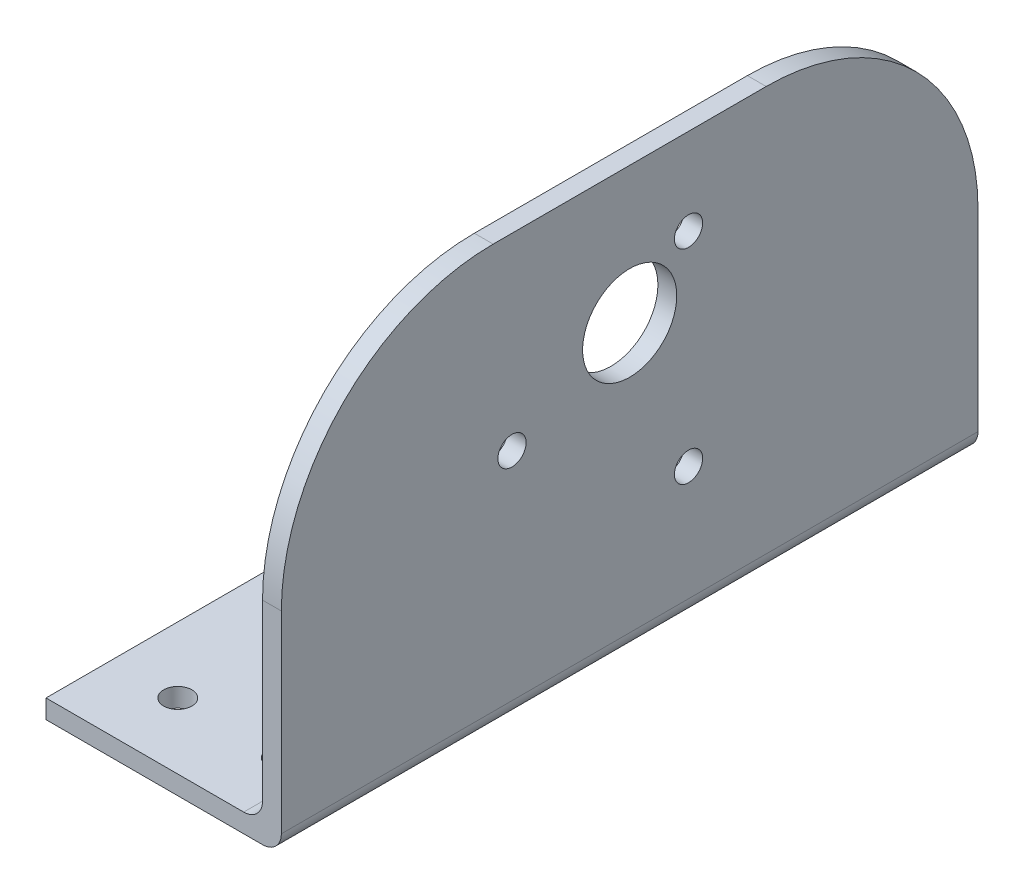
ISO-10303-21;
HEADER;
FILE_DESCRIPTION(('STEP AP214'),'2;1');
FILE_NAME('part.step','',(''),(''),'','','');
FILE_SCHEMA(('AUTOMOTIVE_DESIGN { 1 0 10303 214 1 1 1 1 }'));
ENDSEC;
DATA;
#1=APPLICATION_CONTEXT('core data for automotive mechanical design processes');
#2=APPLICATION_PROTOCOL_DEFINITION('international standard','automotive_design',2000,#1);
#3=PRODUCT_CONTEXT('',#1,'mechanical');
#4=PRODUCT('Part','Part','',(#3));
#5=PRODUCT_RELATED_PRODUCT_CATEGORY('part','',(#4));
#6=PRODUCT_DEFINITION_FORMATION('','',#4);
#7=PRODUCT_DEFINITION_CONTEXT('part definition',#1,'design');
#8=PRODUCT_DEFINITION('design','',#6,#7);
#9=PRODUCT_DEFINITION_SHAPE('','',#8);
#10=(LENGTH_UNIT() NAMED_UNIT(*) SI_UNIT(.MILLI.,.METRE.));
#11=(NAMED_UNIT(*) PLANE_ANGLE_UNIT() SI_UNIT($,.RADIAN.));
#12=(NAMED_UNIT(*) SI_UNIT($,.STERADIAN.) SOLID_ANGLE_UNIT());
#13=UNCERTAINTY_MEASURE_WITH_UNIT(LENGTH_MEASURE(1.E-05),#10,'distance_accuracy_value','');
#14=(GEOMETRIC_REPRESENTATION_CONTEXT(3) GLOBAL_UNCERTAINTY_ASSIGNED_CONTEXT((#13)) GLOBAL_UNIT_ASSIGNED_CONTEXT((#10,
#11,#12)) REPRESENTATION_CONTEXT('',''));
#15=CARTESIAN_POINT('',(0.,0.,0.));
#16=DIRECTION('',(0.,0.,1.));
#17=DIRECTION('',(1.,0.,0.));
#18=AXIS2_PLACEMENT_3D('',#15,#16,#17);
#19=CARTESIAN_POINT('',(0.,22.5,-14.5));
#20=DIRECTION('',(1.,0.,0.));
#21=DIRECTION('',(0.,0.,-1.));
#22=AXIS2_PLACEMENT_3D('',#19,#20,#21);
#23=PLANE('',#22);
#24=CARTESIAN_POINT('',(0.,24.9999999999998,12.4999999999999));
#25=DIRECTION('',(1.,0.,0.));
#26=DIRECTION('',(0.,0.,-1.));
#27=AXIS2_PLACEMENT_3D('',#24,#25,#26);
#28=CIRCLE('',#27,1.5);
#29=CARTESIAN_POINT('',(0.,24.9999999999998,10.9999999999999));
#30=VERTEX_POINT('',#29);
#31=EDGE_CURVE('E239',#30,#30,#28,.T.);
#32=ORIENTED_EDGE('',*,*,#31,.T.);
#33=EDGE_LOOP('',(#32));
#34=FACE_BOUND('',#33,.T.);
#35=CARTESIAN_POINT('',(0.,14.1746824526946,-6.24999999999998));
#36=DIRECTION('',(1.,0.,0.));
#37=DIRECTION('',(0.,0.,-1.));
#38=AXIS2_PLACEMENT_3D('',#35,#36,#37);
#39=CIRCLE('',#38,1.5);
#40=CARTESIAN_POINT('',(0.,14.1746824526946,-7.74999999999998));
#41=VERTEX_POINT('',#40);
#42=EDGE_CURVE('E233',#41,#41,#39,.T.);
#43=ORIENTED_EDGE('',*,*,#42,.T.);
#44=EDGE_LOOP('',(#43));
#45=FACE_BOUND('',#44,.T.);
#46=CARTESIAN_POINT('',(0.,30.5,0.));
#47=DIRECTION('',(1.,0.,0.));
#48=DIRECTION('',(0.,0.,-1.));
#49=AXIS2_PLACEMENT_3D('',#46,#47,#48);
#50=CIRCLE('',#49,5.);
#51=CARTESIAN_POINT('',(0.,30.5,-5.));
#52=VERTEX_POINT('',#51);
#53=EDGE_CURVE('E227',#52,#52,#50,.T.);
#54=ORIENTED_EDGE('',*,*,#53,.T.);
#55=EDGE_LOOP('',(#54));
#56=FACE_BOUND('',#55,.T.);
#57=CARTESIAN_POINT('',(0.,35.8253175473055,-6.24999999999993));
#58=DIRECTION('',(1.,0.,0.));
#59=DIRECTION('',(0.,0.,-1.));
#60=AXIS2_PLACEMENT_3D('',#57,#58,#59);
#61=CIRCLE('',#60,1.50000000000003);
#62=CARTESIAN_POINT('',(0.,35.8253175473055,-7.74999999999996));
#63=VERTEX_POINT('',#62);
#64=EDGE_CURVE('E144',#63,#63,#61,.T.);
#65=ORIENTED_EDGE('',*,*,#64,.T.);
#66=EDGE_LOOP('',(#65));
#67=FACE_BOUND('',#66,.T.);
#68=DIRECTION('',(0.,1.,0.));
#69=VECTOR('',#68,1.);
#70=CARTESIAN_POINT('',(0.,22.5,-37.));
#71=LINE('',#70,#69);
#72=CARTESIAN_POINT('',(0.,4.,-37.));
#73=VERTEX_POINT('',#72);
#74=CARTESIAN_POINT('',(0.,22.5,-37.));
#75=VERTEX_POINT('',#74);
#76=EDGE_CURVE('E169',#73,#75,#71,.T.);
#77=ORIENTED_EDGE('',*,*,#76,.F.);
#78=DIRECTION('',(0.,0.,-1.));
#79=VECTOR('',#78,1.);
#80=CARTESIAN_POINT('',(0.,4.,37.));
#81=LINE('',#80,#79);
#82=CARTESIAN_POINT('',(0.,4.,37.));
#83=VERTEX_POINT('',#82);
#84=EDGE_CURVE('E167',#73,#83,#81,.F.);
#85=ORIENTED_EDGE('',*,*,#84,.T.);
#86=DIRECTION('',(0.,-1.,0.));
#87=VECTOR('',#86,1.);
#88=CARTESIAN_POINT('',(0.,22.5,37.));
#89=LINE('',#88,#87);
#90=CARTESIAN_POINT('',(0.,22.5,37.));
#91=VERTEX_POINT('',#90);
#92=EDGE_CURVE('E173',#91,#83,#89,.T.);
#93=ORIENTED_EDGE('',*,*,#92,.F.);
#94=CARTESIAN_POINT('',(0.,22.5,14.5));
#95=DIRECTION('',(1.,0.,0.));
#96=DIRECTION('',(0.,0.,1.));
#97=AXIS2_PLACEMENT_3D('',#94,#95,#96);
#98=CIRCLE('',#97,22.5);
#99=CARTESIAN_POINT('',(0.,45.,14.5));
#100=VERTEX_POINT('',#99);
#101=EDGE_CURVE('E200',#100,#91,#98,.T.);
#102=ORIENTED_EDGE('',*,*,#101,.F.);
#103=DIRECTION('',(0.,0.,1.));
#104=VECTOR('',#103,1.);
#105=CARTESIAN_POINT('',(0.,45.,14.5));
#106=LINE('',#105,#104);
#107=CARTESIAN_POINT('',(0.,45.,-14.5));
#108=VERTEX_POINT('',#107);
#109=EDGE_CURVE('E155',#108,#100,#106,.T.);
#110=ORIENTED_EDGE('',*,*,#109,.F.);
#111=CARTESIAN_POINT('',(0.,22.5,-14.5));
#112=DIRECTION('',(1.,0.,0.));
#113=DIRECTION('',(0.,0.,-1.));
#114=AXIS2_PLACEMENT_3D('',#111,#112,#113);
#115=CIRCLE('',#114,22.5);
#116=EDGE_CURVE('E150',#75,#108,#115,.T.);
#117=ORIENTED_EDGE('',*,*,#116,.F.);
#118=EDGE_LOOP('',(#77,#85,#93,#102,#110,#117));
#119=FACE_BOUND('',#118,.T.);
#120=ADVANCED_FACE('F38',(#34,#45,#56,#67,#119),#23,.F.);
#121=CARTESIAN_POINT('',(2.,22.5,-14.5));
#122=DIRECTION('',(-1.,0.,0.));
#123=DIRECTION('',(0.,0.,1.));
#124=AXIS2_PLACEMENT_3D('',#121,#122,#123);
#125=CYLINDRICAL_SURFACE('',#124,22.5);
#126=ORIENTED_EDGE('',*,*,#116,.T.);
#127=DIRECTION('',(-1.,0.,0.));
#128=VECTOR('',#127,1.);
#129=CARTESIAN_POINT('',(2.,45.,-14.5));
#130=LINE('',#129,#128);
#131=CARTESIAN_POINT('',(2.,45.,-14.5));
#132=VERTEX_POINT('',#131);
#133=EDGE_CURVE('E168',#132,#108,#130,.T.);
#134=ORIENTED_EDGE('',*,*,#133,.F.);
#135=CARTESIAN_POINT('',(2.,22.5,-14.5));
#136=DIRECTION('',(1.,0.,0.));
#137=DIRECTION('',(0.,0.,-1.));
#138=AXIS2_PLACEMENT_3D('',#135,#136,#137);
#139=CIRCLE('',#138,22.5);
#140=CARTESIAN_POINT('',(2.,22.5,-37.));
#141=VERTEX_POINT('',#140);
#142=EDGE_CURVE('E172',#141,#132,#139,.T.);
#143=ORIENTED_EDGE('',*,*,#142,.F.);
#144=DIRECTION('',(-1.,0.,0.));
#145=VECTOR('',#144,1.);
#146=CARTESIAN_POINT('',(2.,22.5,-37.));
#147=LINE('',#146,#145);
#148=EDGE_CURVE('E180',#141,#75,#147,.T.);
#149=ORIENTED_EDGE('',*,*,#148,.T.);
#150=EDGE_LOOP('',(#126,#134,#143,#149));
#151=FACE_BOUND('',#150,.T.);
#152=ADVANCED_FACE('F279',(#151),#125,.T.);
#153=CARTESIAN_POINT('',(2.,45.,14.5));
#154=DIRECTION('',(0.,-1.,0.));
#155=DIRECTION('',(0.,0.,-1.));
#156=AXIS2_PLACEMENT_3D('',#153,#154,#155);
#157=PLANE('',#156);
#158=ORIENTED_EDGE('',*,*,#109,.T.);
#159=DIRECTION('',(-1.,0.,0.));
#160=VECTOR('',#159,1.);
#161=CARTESIAN_POINT('',(2.,45.,14.5));
#162=LINE('',#161,#160);
#163=CARTESIAN_POINT('',(2.,45.,14.5));
#164=VERTEX_POINT('',#163);
#165=EDGE_CURVE('E193',#164,#100,#162,.T.);
#166=ORIENTED_EDGE('',*,*,#165,.F.);
#167=DIRECTION('',(0.,0.,1.));
#168=VECTOR('',#167,1.);
#169=CARTESIAN_POINT('',(2.,45.,14.5));
#170=LINE('',#169,#168);
#171=EDGE_CURVE('E216',#132,#164,#170,.T.);
#172=ORIENTED_EDGE('',*,*,#171,.F.);
#173=ORIENTED_EDGE('',*,*,#133,.T.);
#174=EDGE_LOOP('',(#158,#166,#172,#173));
#175=FACE_BOUND('',#174,.T.);
#176=ADVANCED_FACE('F285',(#175),#157,.F.);
#177=CARTESIAN_POINT('',(2.,22.5,14.5));
#178=DIRECTION('',(-1.,0.,0.));
#179=DIRECTION('',(0.,0.,1.));
#180=AXIS2_PLACEMENT_3D('',#177,#178,#179);
#181=CYLINDRICAL_SURFACE('',#180,22.5);
#182=ORIENTED_EDGE('',*,*,#101,.T.);
#183=DIRECTION('',(-1.,0.,0.));
#184=VECTOR('',#183,1.);
#185=CARTESIAN_POINT('',(2.,22.5,37.));
#186=LINE('',#185,#184);
#187=CARTESIAN_POINT('',(2.,22.5,37.));
#188=VERTEX_POINT('',#187);
#189=EDGE_CURVE('E190',#188,#91,#186,.T.);
#190=ORIENTED_EDGE('',*,*,#189,.F.);
#191=CARTESIAN_POINT('',(2.,22.5,14.5));
#192=DIRECTION('',(1.,0.,0.));
#193=DIRECTION('',(0.,0.,1.));
#194=AXIS2_PLACEMENT_3D('',#191,#192,#193);
#195=CIRCLE('',#194,22.5);
#196=EDGE_CURVE('E214',#164,#188,#195,.T.);
#197=ORIENTED_EDGE('',*,*,#196,.F.);
#198=ORIENTED_EDGE('',*,*,#165,.T.);
#199=EDGE_LOOP('',(#182,#190,#197,#198));
#200=FACE_BOUND('',#199,.T.);
#201=ADVANCED_FACE('F302',(#200),#181,.T.);
#202=CARTESIAN_POINT('',(2.,22.5,37.));
#203=DIRECTION('',(0.,0.,-1.));
#204=DIRECTION('',(0.,1.,0.));
#205=AXIS2_PLACEMENT_3D('',#202,#203,#204);
#206=PLANE('',#205);
#207=DIRECTION('',(-1.,0.,0.));
#208=VECTOR('',#207,1.);
#209=CARTESIAN_POINT('',(2.,0.,37.));
#210=LINE('',#209,#208);
#211=CARTESIAN_POINT('',(0.,0.,37.));
#212=VERTEX_POINT('',#211);
#213=CARTESIAN_POINT('',(-23.,0.,37.));
#214=VERTEX_POINT('',#213);
#215=EDGE_CURVE('E187',#212,#214,#210,.T.);
#216=ORIENTED_EDGE('',*,*,#215,.F.);
#217=CARTESIAN_POINT('',(0.,2.,37.));
#218=DIRECTION('',(0.,0.,-1.));
#219=DIRECTION('',(0.,1.,0.));
#220=AXIS2_PLACEMENT_3D('',#217,#218,#219);
#221=CIRCLE('',#220,2.);
#222=CARTESIAN_POINT('',(2.,2.,37.));
#223=VERTEX_POINT('',#222);
#224=EDGE_CURVE('E320',#212,#223,#221,.F.);
#225=ORIENTED_EDGE('',*,*,#224,.T.);
#226=DIRECTION('',(0.,-1.,0.));
#227=VECTOR('',#226,1.);
#228=CARTESIAN_POINT('',(2.,22.5,37.));
#229=LINE('',#228,#227);
#230=EDGE_CURVE('E211',#188,#223,#229,.T.);
#231=ORIENTED_EDGE('',*,*,#230,.F.);
#232=ORIENTED_EDGE('',*,*,#189,.T.);
#233=ORIENTED_EDGE('',*,*,#92,.T.);
#234=CARTESIAN_POINT('',(-2.,4.,37.));
#235=DIRECTION('',(0.,0.,-1.));
#236=DIRECTION('',(0.,1.,0.));
#237=AXIS2_PLACEMENT_3D('',#234,#235,#236);
#238=CIRCLE('',#237,2.);
#239=CARTESIAN_POINT('',(-2.,2.,37.));
#240=VERTEX_POINT('',#239);
#241=EDGE_CURVE('E11',#83,#240,#238,.T.);
#242=ORIENTED_EDGE('',*,*,#241,.T.);
#243=DIRECTION('',(1.,0.,0.));
#244=VECTOR('',#243,1.);
#245=CARTESIAN_POINT('',(-23.,2.,37.));
#246=LINE('',#245,#244);
#247=CARTESIAN_POINT('',(-23.,2.,37.));
#248=VERTEX_POINT('',#247);
#249=EDGE_CURVE('E128',#248,#240,#246,.T.);
#250=ORIENTED_EDGE('',*,*,#249,.F.);
#251=DIRECTION('',(0.,1.,0.));
#252=VECTOR('',#251,1.);
#253=CARTESIAN_POINT('',(-23.,0.,37.));
#254=LINE('',#253,#252);
#255=EDGE_CURVE('E136',#214,#248,#254,.T.);
#256=ORIENTED_EDGE('',*,*,#255,.F.);
#257=EDGE_LOOP('',(#216,#225,#231,#232,#233,#242,#250,#256));
#258=FACE_BOUND('',#257,.T.);
#259=ADVANCED_FACE('F146',(#258),#206,.F.);
#260=CARTESIAN_POINT('',(2.,0.,-37.));
#261=DIRECTION('',(0.,1.,0.));
#262=DIRECTION('',(0.,0.,1.));
#263=AXIS2_PLACEMENT_3D('',#260,#261,#262);
#264=PLANE('',#263);
#265=CARTESIAN_POINT('',(-16.,0.,30.));
#266=DIRECTION('',(0.,-1.,0.));
#267=DIRECTION('',(0.,0.,1.));
#268=AXIS2_PLACEMENT_3D('',#265,#266,#267);
#269=CIRCLE('',#268,1.5);
#270=CARTESIAN_POINT('',(-16.,0.,31.5));
#271=VERTEX_POINT('',#270);
#272=EDGE_CURVE('E259',#271,#271,#269,.T.);
#273=ORIENTED_EDGE('',*,*,#272,.F.);
#274=EDGE_LOOP('',(#273));
#275=FACE_BOUND('',#274,.T.);
#276=CARTESIAN_POINT('',(-5.,0.,30.));
#277=DIRECTION('',(0.,-1.,0.));
#278=DIRECTION('',(0.,0.,1.));
#279=AXIS2_PLACEMENT_3D('',#276,#277,#278);
#280=CIRCLE('',#279,1.5);
#281=CARTESIAN_POINT('',(-5.,0.,31.5));
#282=VERTEX_POINT('',#281);
#283=EDGE_CURVE('E256',#282,#282,#280,.T.);
#284=ORIENTED_EDGE('',*,*,#283,.F.);
#285=EDGE_LOOP('',(#284));
#286=FACE_BOUND('',#285,.T.);
#287=CARTESIAN_POINT('',(-5.,0.,-30.));
#288=DIRECTION('',(0.,-1.,0.));
#289=DIRECTION('',(0.,0.,-1.));
#290=AXIS2_PLACEMENT_3D('',#287,#288,#289);
#291=CIRCLE('',#290,1.5);
#292=CARTESIAN_POINT('',(-5.,0.,-31.5));
#293=VERTEX_POINT('',#292);
#294=EDGE_CURVE('E252',#293,#293,#291,.T.);
#295=ORIENTED_EDGE('',*,*,#294,.F.);
#296=EDGE_LOOP('',(#295));
#297=FACE_BOUND('',#296,.T.);
#298=CARTESIAN_POINT('',(-16.,0.,-30.));
#299=DIRECTION('',(0.,-1.,0.));
#300=DIRECTION('',(0.,0.,-1.));
#301=AXIS2_PLACEMENT_3D('',#298,#299,#300);
#302=CIRCLE('',#301,1.5);
#303=CARTESIAN_POINT('',(-16.,0.,-31.5));
#304=VERTEX_POINT('',#303);
#305=EDGE_CURVE('E248',#304,#304,#302,.T.);
#306=ORIENTED_EDGE('',*,*,#305,.F.);
#307=EDGE_LOOP('',(#306));
#308=FACE_BOUND('',#307,.T.);
#309=DIRECTION('',(-1.,0.,0.));
#310=VECTOR('',#309,1.);
#311=CARTESIAN_POINT('',(2.,0.,-37.));
#312=LINE('',#311,#310);
#313=CARTESIAN_POINT('',(0.,0.,-37.));
#314=VERTEX_POINT('',#313);
#315=CARTESIAN_POINT('',(-23.,0.,-37.));
#316=VERTEX_POINT('',#315);
#317=EDGE_CURVE('E183',#314,#316,#312,.T.);
#318=ORIENTED_EDGE('',*,*,#317,.F.);
#319=DIRECTION('',(0.,0.,-1.));
#320=VECTOR('',#319,1.);
#321=CARTESIAN_POINT('',(0.,0.,37.));
#322=LINE('',#321,#320);
#323=EDGE_CURVE('E59',#314,#212,#322,.F.);
#324=ORIENTED_EDGE('',*,*,#323,.T.);
#325=ORIENTED_EDGE('',*,*,#215,.T.);
#326=DIRECTION('',(0.,0.,1.));
#327=VECTOR('',#326,1.);
#328=CARTESIAN_POINT('',(-23.,0.,37.));
#329=LINE('',#328,#327);
#330=EDGE_CURVE('E142',#316,#214,#329,.T.);
#331=ORIENTED_EDGE('',*,*,#330,.F.);
#332=EDGE_LOOP('',(#318,#324,#325,#331));
#333=FACE_BOUND('',#332,.T.);
#334=ADVANCED_FACE('F296',(#275,#286,#297,#308,#333),#264,.F.);
#335=CARTESIAN_POINT('',(2.,22.5,-37.));
#336=DIRECTION('',(0.,0.,1.));
#337=DIRECTION('',(0.,-1.,0.));
#338=AXIS2_PLACEMENT_3D('',#335,#336,#337);
#339=PLANE('',#338);
#340=DIRECTION('',(0.,1.,0.));
#341=VECTOR('',#340,1.);
#342=CARTESIAN_POINT('',(2.,22.5,-37.));
#343=LINE('',#342,#341);
#344=CARTESIAN_POINT('',(2.,2.00000000000001,-37.));
#345=VERTEX_POINT('',#344);
#346=EDGE_CURVE('E184',#345,#141,#343,.T.);
#347=ORIENTED_EDGE('',*,*,#346,.F.);
#348=CARTESIAN_POINT('',(0.,2.,-37.));
#349=DIRECTION('',(0.,0.,1.));
#350=DIRECTION('',(0.,-1.,0.));
#351=AXIS2_PLACEMENT_3D('',#348,#349,#350);
#352=CIRCLE('',#351,2.);
#353=EDGE_CURVE('E67',#345,#314,#352,.F.);
#354=ORIENTED_EDGE('',*,*,#353,.T.);
#355=ORIENTED_EDGE('',*,*,#317,.T.);
#356=DIRECTION('',(0.,-1.,0.));
#357=VECTOR('',#356,1.);
#358=CARTESIAN_POINT('',(-23.,0.,-37.));
#359=LINE('',#358,#357);
#360=CARTESIAN_POINT('',(-23.,1.99999999999999,-37.));
#361=VERTEX_POINT('',#360);
#362=EDGE_CURVE('E135',#361,#316,#359,.T.);
#363=ORIENTED_EDGE('',*,*,#362,.F.);
#364=DIRECTION('',(1.,0.,0.));
#365=VECTOR('',#364,1.);
#366=CARTESIAN_POINT('',(-23.,1.99999999999999,-37.));
#367=LINE('',#366,#365);
#368=CARTESIAN_POINT('',(-2.,1.99999999999999,-37.));
#369=VERTEX_POINT('',#368);
#370=EDGE_CURVE('E131',#361,#369,#367,.T.);
#371=ORIENTED_EDGE('',*,*,#370,.T.);
#372=CARTESIAN_POINT('',(-2.,3.99999999999999,-37.));
#373=DIRECTION('',(0.,0.,1.));
#374=DIRECTION('',(0.,-1.,0.));
#375=AXIS2_PLACEMENT_3D('',#372,#373,#374);
#376=CIRCLE('',#375,2.);
#377=EDGE_CURVE('E48',#369,#73,#376,.T.);
#378=ORIENTED_EDGE('',*,*,#377,.T.);
#379=ORIENTED_EDGE('',*,*,#76,.T.);
#380=ORIENTED_EDGE('',*,*,#148,.F.);
#381=EDGE_LOOP('',(#347,#354,#355,#363,#371,#378,#379,#380));
#382=FACE_BOUND('',#381,.T.);
#383=ADVANCED_FACE('F293',(#382),#339,.F.);
#384=CARTESIAN_POINT('',(2.,22.5,-14.5));
#385=DIRECTION('',(1.,0.,0.));
#386=DIRECTION('',(0.,0.,-1.));
#387=AXIS2_PLACEMENT_3D('',#384,#385,#386);
#388=PLANE('',#387);
#389=CARTESIAN_POINT('',(2.,24.9999999999998,12.4999999999999));
#390=DIRECTION('',(1.,0.,0.));
#391=DIRECTION('',(0.,0.,-1.));
#392=AXIS2_PLACEMENT_3D('',#389,#390,#391);
#393=CIRCLE('',#392,1.5);
#394=CARTESIAN_POINT('',(2.,24.9999999999998,10.9999999999999));
#395=VERTEX_POINT('',#394);
#396=EDGE_CURVE('E243',#395,#395,#393,.T.);
#397=ORIENTED_EDGE('',*,*,#396,.F.);
#398=EDGE_LOOP('',(#397));
#399=FACE_BOUND('',#398,.T.);
#400=CARTESIAN_POINT('',(2.,14.1746824526946,-6.24999999999998));
#401=DIRECTION('',(1.,0.,0.));
#402=DIRECTION('',(0.,0.,-1.));
#403=AXIS2_PLACEMENT_3D('',#400,#401,#402);
#404=CIRCLE('',#403,1.5);
#405=CARTESIAN_POINT('',(2.,14.1746824526946,-7.74999999999998));
#406=VERTEX_POINT('',#405);
#407=EDGE_CURVE('E236',#406,#406,#404,.T.);
#408=ORIENTED_EDGE('',*,*,#407,.F.);
#409=EDGE_LOOP('',(#408));
#410=FACE_BOUND('',#409,.T.);
#411=CARTESIAN_POINT('',(2.,30.5,0.));
#412=DIRECTION('',(1.,0.,0.));
#413=DIRECTION('',(0.,0.,-1.));
#414=AXIS2_PLACEMENT_3D('',#411,#412,#413);
#415=CIRCLE('',#414,5.);
#416=CARTESIAN_POINT('',(2.,30.5,-5.));
#417=VERTEX_POINT('',#416);
#418=EDGE_CURVE('E230',#417,#417,#415,.T.);
#419=ORIENTED_EDGE('',*,*,#418,.F.);
#420=EDGE_LOOP('',(#419));
#421=FACE_BOUND('',#420,.T.);
#422=CARTESIAN_POINT('',(2.,35.8253175473055,-6.24999999999993));
#423=DIRECTION('',(1.,0.,0.));
#424=DIRECTION('',(0.,0.,-1.));
#425=AXIS2_PLACEMENT_3D('',#422,#423,#424);
#426=CIRCLE('',#425,1.50000000000003);
#427=CARTESIAN_POINT('',(2.,35.8253175473055,-7.74999999999996));
#428=VERTEX_POINT('',#427);
#429=EDGE_CURVE('E224',#428,#428,#426,.T.);
#430=ORIENTED_EDGE('',*,*,#429,.F.);
#431=EDGE_LOOP('',(#430));
#432=FACE_BOUND('',#431,.T.);
#433=ORIENTED_EDGE('',*,*,#230,.T.);
#434=DIRECTION('',(0.,0.,-1.));
#435=VECTOR('',#434,1.);
#436=CARTESIAN_POINT('',(2.,2.,-37.));
#437=LINE('',#436,#435);
#438=EDGE_CURVE('E323',#223,#345,#437,.T.);
#439=ORIENTED_EDGE('',*,*,#438,.T.);
#440=ORIENTED_EDGE('',*,*,#346,.T.);
#441=ORIENTED_EDGE('',*,*,#142,.T.);
#442=ORIENTED_EDGE('',*,*,#171,.T.);
#443=ORIENTED_EDGE('',*,*,#196,.T.);
#444=EDGE_LOOP('',(#433,#439,#440,#441,#442,#443));
#445=FACE_BOUND('',#444,.T.);
#446=ADVANCED_FACE('F291',(#399,#410,#421,#432,#445),#388,.T.);
#447=CARTESIAN_POINT('',(-23.,2.,37.));
#448=DIRECTION('',(0.,-1.,0.));
#449=DIRECTION('',(0.,0.,-1.));
#450=AXIS2_PLACEMENT_3D('',#447,#448,#449);
#451=PLANE('',#450);
#452=CARTESIAN_POINT('',(-16.,2.,30.));
#453=DIRECTION('',(0.,-1.,0.));
#454=DIRECTION('',(0.,0.,-1.));
#455=AXIS2_PLACEMENT_3D('',#452,#453,#454);
#456=CIRCLE('',#455,1.5);
#457=CARTESIAN_POINT('',(-16.,2.,28.5));
#458=VERTEX_POINT('',#457);
#459=EDGE_CURVE('E42',#458,#458,#456,.T.);
#460=ORIENTED_EDGE('',*,*,#459,.T.);
#461=EDGE_LOOP('',(#460));
#462=FACE_BOUND('',#461,.T.);
#463=CARTESIAN_POINT('',(-5.,2.,30.));
#464=DIRECTION('',(0.,-1.,0.));
#465=DIRECTION('',(0.,0.,-1.));
#466=AXIS2_PLACEMENT_3D('',#463,#464,#465);
#467=CIRCLE('',#466,1.5);
#468=CARTESIAN_POINT('',(-5.,2.,28.5));
#469=VERTEX_POINT('',#468);
#470=EDGE_CURVE('E255',#469,#469,#467,.T.);
#471=ORIENTED_EDGE('',*,*,#470,.T.);
#472=EDGE_LOOP('',(#471));
#473=FACE_BOUND('',#472,.T.);
#474=CARTESIAN_POINT('',(-5.,1.99999999999999,-30.));
#475=DIRECTION('',(0.,-1.,0.));
#476=DIRECTION('',(0.,0.,-1.));
#477=AXIS2_PLACEMENT_3D('',#474,#475,#476);
#478=CIRCLE('',#477,1.5);
#479=CARTESIAN_POINT('',(-5.,1.99999999999999,-31.5));
#480=VERTEX_POINT('',#479);
#481=EDGE_CURVE('E251',#480,#480,#478,.T.);
#482=ORIENTED_EDGE('',*,*,#481,.T.);
#483=EDGE_LOOP('',(#482));
#484=FACE_BOUND('',#483,.T.);
#485=CARTESIAN_POINT('',(-16.,1.99999999999999,-30.));
#486=DIRECTION('',(0.,-1.,0.));
#487=DIRECTION('',(0.,0.,-1.));
#488=AXIS2_PLACEMENT_3D('',#485,#486,#487);
#489=CIRCLE('',#488,1.5);
#490=CARTESIAN_POINT('',(-16.,1.99999999999999,-31.5));
#491=VERTEX_POINT('',#490);
#492=EDGE_CURVE('E247',#491,#491,#489,.T.);
#493=ORIENTED_EDGE('',*,*,#492,.T.);
#494=EDGE_LOOP('',(#493));
#495=FACE_BOUND('',#494,.T.);
#496=ORIENTED_EDGE('',*,*,#249,.T.);
#497=DIRECTION('',(0.,0.,-1.));
#498=VECTOR('',#497,1.);
#499=CARTESIAN_POINT('',(-2.,1.99999999999999,-37.));
#500=LINE('',#499,#498);
#501=EDGE_CURVE('E164',#240,#369,#500,.T.);
#502=ORIENTED_EDGE('',*,*,#501,.T.);
#503=ORIENTED_EDGE('',*,*,#370,.F.);
#504=DIRECTION('',(0.,0.,-1.));
#505=VECTOR('',#504,1.);
#506=CARTESIAN_POINT('',(-23.,2.,37.));
#507=LINE('',#506,#505);
#508=EDGE_CURVE('E123',#248,#361,#507,.T.);
#509=ORIENTED_EDGE('',*,*,#508,.F.);
#510=EDGE_LOOP('',(#496,#502,#503,#509));
#511=FACE_BOUND('',#510,.T.);
#512=ADVANCED_FACE('F125',(#462,#473,#484,#495,#511),#451,.F.);
#513=CARTESIAN_POINT('',(-23.,2.,37.));
#514=DIRECTION('',(-1.,0.,0.));
#515=DIRECTION('',(0.,0.,1.));
#516=AXIS2_PLACEMENT_3D('',#513,#514,#515);
#517=PLANE('',#516);
#518=ORIENTED_EDGE('',*,*,#255,.T.);
#519=ORIENTED_EDGE('',*,*,#508,.T.);
#520=ORIENTED_EDGE('',*,*,#362,.T.);
#521=ORIENTED_EDGE('',*,*,#330,.T.);
#522=EDGE_LOOP('',(#518,#519,#520,#521));
#523=FACE_BOUND('',#522,.T.);
#524=ADVANCED_FACE('F140',(#523),#517,.T.);
#525=CARTESIAN_POINT('',(-2.,4.,37.));
#526=DIRECTION('',(0.,0.,1.));
#527=DIRECTION('',(0.,-1.,0.));
#528=AXIS2_PLACEMENT_3D('',#525,#526,#527);
#529=CYLINDRICAL_SURFACE('',#528,2.);
#530=ORIENTED_EDGE('',*,*,#241,.F.);
#531=ORIENTED_EDGE('',*,*,#84,.F.);
#532=ORIENTED_EDGE('',*,*,#377,.F.);
#533=ORIENTED_EDGE('',*,*,#501,.F.);
#534=EDGE_LOOP('',(#530,#531,#532,#533));
#535=FACE_BOUND('',#534,.T.);
#536=ADVANCED_FACE('F307',(#535),#529,.F.);
#537=CARTESIAN_POINT('',(0.,2.,-14.5));
#538=DIRECTION('',(0.,0.,1.));
#539=DIRECTION('',(1.,0.,0.));
#540=AXIS2_PLACEMENT_3D('',#537,#538,#539);
#541=CYLINDRICAL_SURFACE('',#540,2.);
#542=ORIENTED_EDGE('',*,*,#224,.F.);
#543=ORIENTED_EDGE('',*,*,#323,.F.);
#544=ORIENTED_EDGE('',*,*,#353,.F.);
#545=ORIENTED_EDGE('',*,*,#438,.F.);
#546=EDGE_LOOP('',(#542,#543,#544,#545));
#547=FACE_BOUND('',#546,.T.);
#548=ADVANCED_FACE('F40',(#547),#541,.T.);
#549=CARTESIAN_POINT('',(-23.,35.8253175473055,-6.24999999999993));
#550=DIRECTION('',(1.,0.,0.));
#551=DIRECTION('',(0.,0.,-1.));
#552=AXIS2_PLACEMENT_3D('',#549,#550,#551);
#553=CYLINDRICAL_SURFACE('',#552,1.50000000000003);
#554=ORIENTED_EDGE('',*,*,#429,.T.);
#555=EDGE_LOOP('',(#554));
#556=FACE_BOUND('',#555,.T.);
#557=ORIENTED_EDGE('',*,*,#64,.F.);
#558=EDGE_LOOP('',(#557));
#559=FACE_BOUND('',#558,.T.);
#560=ADVANCED_FACE('F312',(#556,#559),#553,.F.);
#561=CARTESIAN_POINT('',(-23.,30.5,0.));
#562=DIRECTION('',(1.,0.,0.));
#563=DIRECTION('',(0.,0.,-1.));
#564=AXIS2_PLACEMENT_3D('',#561,#562,#563);
#565=CYLINDRICAL_SURFACE('',#564,5.);
#566=ORIENTED_EDGE('',*,*,#418,.T.);
#567=EDGE_LOOP('',(#566));
#568=FACE_BOUND('',#567,.T.);
#569=ORIENTED_EDGE('',*,*,#53,.F.);
#570=EDGE_LOOP('',(#569));
#571=FACE_BOUND('',#570,.T.);
#572=ADVANCED_FACE('F361',(#568,#571),#565,.F.);
#573=CARTESIAN_POINT('',(-23.,14.1746824526946,-6.24999999999998));
#574=DIRECTION('',(1.,0.,0.));
#575=DIRECTION('',(0.,0.,-1.));
#576=AXIS2_PLACEMENT_3D('',#573,#574,#575);
#577=CYLINDRICAL_SURFACE('',#576,1.5);
#578=ORIENTED_EDGE('',*,*,#407,.T.);
#579=EDGE_LOOP('',(#578));
#580=FACE_BOUND('',#579,.T.);
#581=ORIENTED_EDGE('',*,*,#42,.F.);
#582=EDGE_LOOP('',(#581));
#583=FACE_BOUND('',#582,.T.);
#584=ADVANCED_FACE('F355',(#580,#583),#577,.F.);
#585=CARTESIAN_POINT('',(-23.,24.9999999999998,12.4999999999999));
#586=DIRECTION('',(1.,0.,0.));
#587=DIRECTION('',(0.,0.,-1.));
#588=AXIS2_PLACEMENT_3D('',#585,#586,#587);
#589=CYLINDRICAL_SURFACE('',#588,1.5);
#590=ORIENTED_EDGE('',*,*,#396,.T.);
#591=EDGE_LOOP('',(#590));
#592=FACE_BOUND('',#591,.T.);
#593=ORIENTED_EDGE('',*,*,#31,.F.);
#594=EDGE_LOOP('',(#593));
#595=FACE_BOUND('',#594,.T.);
#596=ADVANCED_FACE('F345',(#592,#595),#589,.F.);
#597=CARTESIAN_POINT('',(-16.,45.,-30.));
#598=DIRECTION('',(0.,-1.,0.));
#599=DIRECTION('',(0.,0.,-1.));
#600=AXIS2_PLACEMENT_3D('',#597,#598,#599);
#601=CYLINDRICAL_SURFACE('',#600,1.5);
#602=ORIENTED_EDGE('',*,*,#305,.T.);
#603=EDGE_LOOP('',(#602));
#604=FACE_BOUND('',#603,.T.);
#605=ORIENTED_EDGE('',*,*,#492,.F.);
#606=EDGE_LOOP('',(#605));
#607=FACE_BOUND('',#606,.T.);
#608=ADVANCED_FACE('F343',(#604,#607),#601,.F.);
#609=CARTESIAN_POINT('',(-5.,45.,-30.));
#610=DIRECTION('',(0.,-1.,0.));
#611=DIRECTION('',(0.,0.,-1.));
#612=AXIS2_PLACEMENT_3D('',#609,#610,#611);
#613=CYLINDRICAL_SURFACE('',#612,1.5);
#614=ORIENTED_EDGE('',*,*,#294,.T.);
#615=EDGE_LOOP('',(#614));
#616=FACE_BOUND('',#615,.T.);
#617=ORIENTED_EDGE('',*,*,#481,.F.);
#618=EDGE_LOOP('',(#617));
#619=FACE_BOUND('',#618,.T.);
#620=ADVANCED_FACE('F275',(#616,#619),#613,.F.);
#621=CARTESIAN_POINT('',(-5.,45.,30.));
#622=DIRECTION('',(0.,-1.,0.));
#623=DIRECTION('',(0.,0.,-1.));
#624=AXIS2_PLACEMENT_3D('',#621,#622,#623);
#625=CYLINDRICAL_SURFACE('',#624,1.5);
#626=ORIENTED_EDGE('',*,*,#283,.T.);
#627=EDGE_LOOP('',(#626));
#628=FACE_BOUND('',#627,.T.);
#629=ORIENTED_EDGE('',*,*,#470,.F.);
#630=EDGE_LOOP('',(#629));
#631=FACE_BOUND('',#630,.T.);
#632=ADVANCED_FACE('F270',(#628,#631),#625,.F.);
#633=CARTESIAN_POINT('',(-16.,45.,30.));
#634=DIRECTION('',(0.,-1.,0.));
#635=DIRECTION('',(0.,0.,-1.));
#636=AXIS2_PLACEMENT_3D('',#633,#634,#635);
#637=CYLINDRICAL_SURFACE('',#636,1.5);
#638=ORIENTED_EDGE('',*,*,#272,.T.);
#639=EDGE_LOOP('',(#638));
#640=FACE_BOUND('',#639,.T.);
#641=ORIENTED_EDGE('',*,*,#459,.F.);
#642=EDGE_LOOP('',(#641));
#643=FACE_BOUND('',#642,.T.);
#644=ADVANCED_FACE('F268',(#640,#643),#637,.F.);
#645=CLOSED_SHELL('',(#120,#152,#176,#201,#259,#334,#383,#446,#512,#524,#536,#548,#560,#572,
#584,#596,#608,#620,#632,#644));
#646=MANIFOLD_SOLID_BREP('B2',#645);
#647=ADVANCED_BREP_SHAPE_REPRESENTATION('',(#18,#646),#14);
#648=SHAPE_DEFINITION_REPRESENTATION(#9,#647);
ENDSEC;
END-ISO-10303-21;
